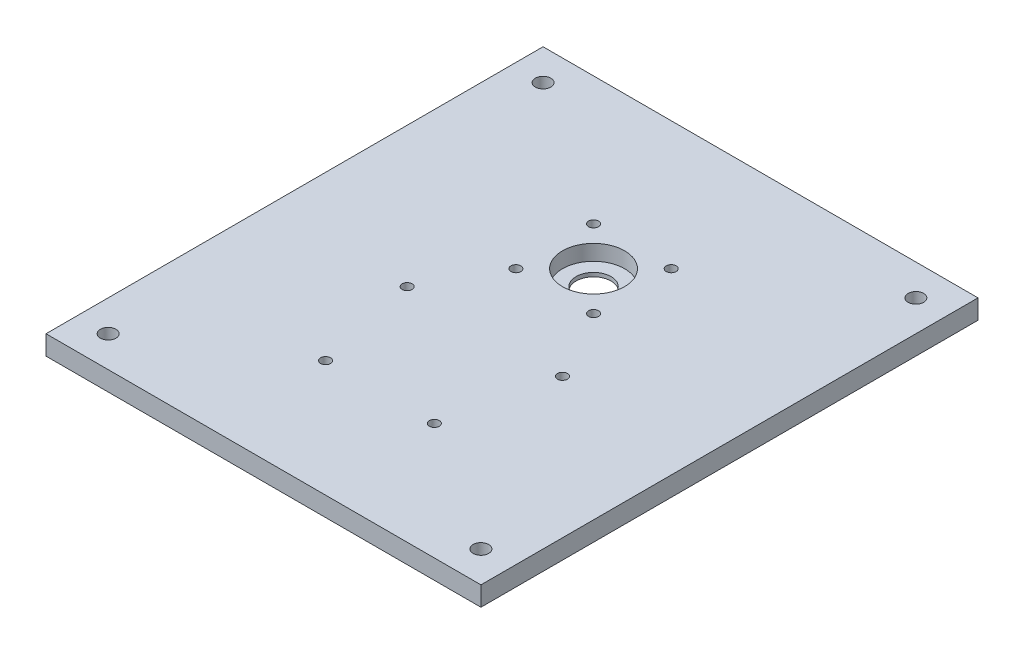
ISO-10303-21;
HEADER;
FILE_DESCRIPTION(('STEP AP214'),'2;1');
FILE_NAME('part.step','',(''),(''),'','','');
FILE_SCHEMA(('AUTOMOTIVE_DESIGN { 1 0 10303 214 1 1 1 1 }'));
ENDSEC;
DATA;
#1=APPLICATION_CONTEXT('core data for automotive mechanical design processes');
#2=APPLICATION_PROTOCOL_DEFINITION('international standard','automotive_design',2000,#1);
#3=PRODUCT_CONTEXT('',#1,'mechanical');
#4=PRODUCT('Part','Part','',(#3));
#5=PRODUCT_RELATED_PRODUCT_CATEGORY('part','',(#4));
#6=PRODUCT_DEFINITION_FORMATION('','',#4);
#7=PRODUCT_DEFINITION_CONTEXT('part definition',#1,'design');
#8=PRODUCT_DEFINITION('design','',#6,#7);
#9=PRODUCT_DEFINITION_SHAPE('','',#8);
#10=(LENGTH_UNIT() NAMED_UNIT(*) SI_UNIT(.MILLI.,.METRE.));
#11=(NAMED_UNIT(*) PLANE_ANGLE_UNIT() SI_UNIT($,.RADIAN.));
#12=(NAMED_UNIT(*) SI_UNIT($,.STERADIAN.) SOLID_ANGLE_UNIT());
#13=UNCERTAINTY_MEASURE_WITH_UNIT(LENGTH_MEASURE(1.E-05),#10,'distance_accuracy_value','');
#14=(GEOMETRIC_REPRESENTATION_CONTEXT(3) GLOBAL_UNCERTAINTY_ASSIGNED_CONTEXT((#13)) GLOBAL_UNIT_ASSIGNED_CONTEXT((#10,
#11,#12)) REPRESENTATION_CONTEXT('',''));
#15=CARTESIAN_POINT('',(0.,0.,0.));
#16=DIRECTION('',(0.,0.,1.));
#17=DIRECTION('',(1.,0.,0.));
#18=AXIS2_PLACEMENT_3D('',#15,#16,#17);
#19=CARTESIAN_POINT('',(-44.45,0.,107.95));
#20=DIRECTION('',(0.,1.,0.));
#21=DIRECTION('',(0.,0.,1.));
#22=AXIS2_PLACEMENT_3D('',#19,#20,#21);
#23=CYLINDRICAL_SURFACE('',#22,4.06400000000002);
#24=CARTESIAN_POINT('',(-44.45,15.875,107.95));
#25=DIRECTION('',(0.,1.,0.));
#26=DIRECTION('',(0.,0.,1.));
#27=AXIS2_PLACEMENT_3D('',#24,#25,#26);
#28=CIRCLE('',#27,4.06400000000002);
#29=CARTESIAN_POINT('',(-44.45,15.875,112.014));
#30=VERTEX_POINT('',#29);
#31=EDGE_CURVE('E200',#30,#30,#28,.T.);
#32=ORIENTED_EDGE('',*,*,#31,.T.);
#33=EDGE_LOOP('',(#32));
#34=FACE_BOUND('',#33,.T.);
#35=CARTESIAN_POINT('',(-44.45,8.89,107.95));
#36=DIRECTION('',(0.,-1.,0.));
#37=DIRECTION('',(0.,0.,-1.));
#38=AXIS2_PLACEMENT_3D('',#35,#36,#37);
#39=CIRCLE('',#38,4.06400000000002);
#40=CARTESIAN_POINT('',(-44.45,8.89,103.886));
#41=VERTEX_POINT('',#40);
#42=EDGE_CURVE('E37',#41,#41,#39,.F.);
#43=ORIENTED_EDGE('',*,*,#42,.F.);
#44=EDGE_LOOP('',(#43));
#45=FACE_BOUND('',#44,.T.);
#46=ADVANCED_FACE('F33',(#34,#45),#23,.F.);
#47=CARTESIAN_POINT('',(44.45,0.,107.95));
#48=DIRECTION('',(0.,1.,0.));
#49=DIRECTION('',(0.,0.,1.));
#50=AXIS2_PLACEMENT_3D('',#47,#48,#49);
#51=CYLINDRICAL_SURFACE('',#50,4.06400000000002);
#52=CARTESIAN_POINT('',(44.45,15.875,107.95));
#53=DIRECTION('',(0.,1.,0.));
#54=DIRECTION('',(0.,0.,1.));
#55=AXIS2_PLACEMENT_3D('',#52,#53,#54);
#56=CIRCLE('',#55,4.06400000000002);
#57=CARTESIAN_POINT('',(44.45,15.875,112.014));
#58=VERTEX_POINT('',#57);
#59=EDGE_CURVE('E203',#58,#58,#56,.T.);
#60=ORIENTED_EDGE('',*,*,#59,.T.);
#61=EDGE_LOOP('',(#60));
#62=FACE_BOUND('',#61,.T.);
#63=CARTESIAN_POINT('',(44.45,8.89,107.95));
#64=DIRECTION('',(0.,-1.,0.));
#65=DIRECTION('',(0.,0.,-1.));
#66=AXIS2_PLACEMENT_3D('',#63,#64,#65);
#67=CIRCLE('',#66,4.06400000000002);
#68=CARTESIAN_POINT('',(44.45,8.89,103.886));
#69=VERTEX_POINT('',#68);
#70=EDGE_CURVE('E144',#69,#69,#67,.F.);
#71=ORIENTED_EDGE('',*,*,#70,.F.);
#72=EDGE_LOOP('',(#71));
#73=FACE_BOUND('',#72,.T.);
#74=ADVANCED_FACE('F259',(#62,#73),#51,.F.);
#75=CARTESIAN_POINT('',(63.5,0.,22.225));
#76=DIRECTION('',(0.,1.,0.));
#77=DIRECTION('',(0.,0.,1.));
#78=AXIS2_PLACEMENT_3D('',#75,#76,#77);
#79=CYLINDRICAL_SURFACE('',#78,4.06400000000002);
#80=CARTESIAN_POINT('',(63.5,15.875,22.225));
#81=DIRECTION('',(0.,1.,0.));
#82=DIRECTION('',(0.,0.,1.));
#83=AXIS2_PLACEMENT_3D('',#80,#81,#82);
#84=CIRCLE('',#83,4.06400000000002);
#85=CARTESIAN_POINT('',(63.5,15.875,26.2890000000001));
#86=VERTEX_POINT('',#85);
#87=EDGE_CURVE('E206',#86,#86,#84,.T.);
#88=ORIENTED_EDGE('',*,*,#87,.T.);
#89=EDGE_LOOP('',(#88));
#90=FACE_BOUND('',#89,.T.);
#91=CARTESIAN_POINT('',(63.5,8.89,22.225));
#92=DIRECTION('',(0.,-1.,0.));
#93=DIRECTION('',(0.,0.,-1.));
#94=AXIS2_PLACEMENT_3D('',#91,#92,#93);
#95=CIRCLE('',#94,4.06400000000002);
#96=CARTESIAN_POINT('',(63.5,8.89,18.161));
#97=VERTEX_POINT('',#96);
#98=EDGE_CURVE('E140',#97,#97,#95,.F.);
#99=ORIENTED_EDGE('',*,*,#98,.F.);
#100=EDGE_LOOP('',(#99));
#101=FACE_BOUND('',#100,.T.);
#102=ADVANCED_FACE('F265',(#90,#101),#79,.F.);
#103=CARTESIAN_POINT('',(-63.5,0.,22.2250000000001));
#104=DIRECTION('',(0.,1.,0.));
#105=DIRECTION('',(0.,0.,1.));
#106=AXIS2_PLACEMENT_3D('',#103,#104,#105);
#107=CYLINDRICAL_SURFACE('',#106,4.06400000000001);
#108=CARTESIAN_POINT('',(-63.5,15.875,22.2250000000001));
#109=DIRECTION('',(0.,1.,0.));
#110=DIRECTION('',(0.,0.,1.));
#111=AXIS2_PLACEMENT_3D('',#108,#109,#110);
#112=CIRCLE('',#111,4.06400000000001);
#113=CARTESIAN_POINT('',(-63.5,15.875,26.2890000000001));
#114=VERTEX_POINT('',#113);
#115=EDGE_CURVE('E209',#114,#114,#112,.T.);
#116=ORIENTED_EDGE('',*,*,#115,.T.);
#117=EDGE_LOOP('',(#116));
#118=FACE_BOUND('',#117,.T.);
#119=CARTESIAN_POINT('',(-63.5,8.89,22.2250000000001));
#120=DIRECTION('',(0.,-1.,0.));
#121=DIRECTION('',(0.,0.,-1.));
#122=AXIS2_PLACEMENT_3D('',#119,#120,#121);
#123=CIRCLE('',#122,4.06400000000001);
#124=CARTESIAN_POINT('',(-63.5,8.89,18.161));
#125=VERTEX_POINT('',#124);
#126=EDGE_CURVE('E135',#125,#125,#123,.F.);
#127=ORIENTED_EDGE('',*,*,#126,.F.);
#128=EDGE_LOOP('',(#127));
#129=FACE_BOUND('',#128,.T.);
#130=ADVANCED_FACE('F274',(#118,#129),#107,.F.);
#131=CARTESIAN_POINT('',(-31.75,0.,-34.925));
#132=DIRECTION('',(0.,1.,0.));
#133=DIRECTION('',(0.,0.,1.));
#134=AXIS2_PLACEMENT_3D('',#131,#132,#133);
#135=CYLINDRICAL_SURFACE('',#134,4.06400000000001);
#136=CARTESIAN_POINT('',(-31.75,15.875,-34.925));
#137=DIRECTION('',(0.,1.,0.));
#138=DIRECTION('',(0.,0.,1.));
#139=AXIS2_PLACEMENT_3D('',#136,#137,#138);
#140=CIRCLE('',#139,4.06400000000001);
#141=CARTESIAN_POINT('',(-31.75,15.875,-30.861));
#142=VERTEX_POINT('',#141);
#143=EDGE_CURVE('E194',#142,#142,#140,.T.);
#144=ORIENTED_EDGE('',*,*,#143,.T.);
#145=EDGE_LOOP('',(#144));
#146=FACE_BOUND('',#145,.T.);
#147=CARTESIAN_POINT('',(-31.75,8.89,-34.925));
#148=DIRECTION('',(0.,-1.,0.));
#149=DIRECTION('',(0.,0.,-1.));
#150=AXIS2_PLACEMENT_3D('',#147,#148,#149);
#151=CIRCLE('',#150,4.06400000000001);
#152=CARTESIAN_POINT('',(-31.75,8.89,-38.989));
#153=VERTEX_POINT('',#152);
#154=EDGE_CURVE('E130',#153,#153,#151,.F.);
#155=ORIENTED_EDGE('',*,*,#154,.F.);
#156=EDGE_LOOP('',(#155));
#157=FACE_BOUND('',#156,.T.);
#158=ADVANCED_FACE('F277',(#146,#157),#135,.F.);
#159=CARTESIAN_POINT('',(31.75,0.,-34.925));
#160=DIRECTION('',(0.,1.,0.));
#161=DIRECTION('',(0.,0.,1.));
#162=AXIS2_PLACEMENT_3D('',#159,#160,#161);
#163=CYLINDRICAL_SURFACE('',#162,4.06400000000001);
#164=CARTESIAN_POINT('',(31.75,15.875,-34.925));
#165=DIRECTION('',(0.,1.,0.));
#166=DIRECTION('',(0.,0.,1.));
#167=AXIS2_PLACEMENT_3D('',#164,#165,#166);
#168=CIRCLE('',#167,4.06400000000001);
#169=CARTESIAN_POINT('',(31.75,15.875,-30.861));
#170=VERTEX_POINT('',#169);
#171=EDGE_CURVE('E113',#170,#170,#168,.T.);
#172=ORIENTED_EDGE('',*,*,#171,.T.);
#173=EDGE_LOOP('',(#172));
#174=FACE_BOUND('',#173,.T.);
#175=CARTESIAN_POINT('',(31.75,8.89,-34.925));
#176=DIRECTION('',(0.,-1.,0.));
#177=DIRECTION('',(0.,0.,-1.));
#178=AXIS2_PLACEMENT_3D('',#175,#176,#177);
#179=CIRCLE('',#178,4.06400000000001);
#180=CARTESIAN_POINT('',(31.75,8.89,-38.989));
#181=VERTEX_POINT('',#180);
#182=EDGE_CURVE('E125',#181,#181,#179,.F.);
#183=ORIENTED_EDGE('',*,*,#182,.F.);
#184=EDGE_LOOP('',(#183));
#185=FACE_BOUND('',#184,.T.);
#186=ADVANCED_FACE('F415',(#174,#185),#163,.F.);
#187=CARTESIAN_POINT('',(31.75,0.,-98.425));
#188=DIRECTION('',(0.,1.,0.));
#189=DIRECTION('',(0.,0.,1.));
#190=AXIS2_PLACEMENT_3D('',#187,#188,#189);
#191=CYLINDRICAL_SURFACE('',#190,4.06400000000002);
#192=CARTESIAN_POINT('',(31.75,15.875,-98.425));
#193=DIRECTION('',(0.,1.,0.));
#194=DIRECTION('',(0.,0.,1.));
#195=AXIS2_PLACEMENT_3D('',#192,#193,#194);
#196=CIRCLE('',#195,4.06400000000002);
#197=CARTESIAN_POINT('',(31.75,15.875,-94.361));
#198=VERTEX_POINT('',#197);
#199=EDGE_CURVE('E191',#198,#198,#196,.T.);
#200=ORIENTED_EDGE('',*,*,#199,.T.);
#201=EDGE_LOOP('',(#200));
#202=FACE_BOUND('',#201,.T.);
#203=CARTESIAN_POINT('',(31.75,8.89,-98.425));
#204=DIRECTION('',(0.,-1.,0.));
#205=DIRECTION('',(0.,0.,-1.));
#206=AXIS2_PLACEMENT_3D('',#203,#204,#205);
#207=CIRCLE('',#206,4.06400000000002);
#208=CARTESIAN_POINT('',(31.75,8.89,-102.489));
#209=VERTEX_POINT('',#208);
#210=EDGE_CURVE('E120',#209,#209,#207,.F.);
#211=ORIENTED_EDGE('',*,*,#210,.F.);
#212=EDGE_LOOP('',(#211));
#213=FACE_BOUND('',#212,.T.);
#214=ADVANCED_FACE('F424',(#202,#213),#191,.F.);
#215=CARTESIAN_POINT('',(-31.75,0.,-98.425));
#216=DIRECTION('',(0.,1.,0.));
#217=DIRECTION('',(0.,0.,1.));
#218=AXIS2_PLACEMENT_3D('',#215,#216,#217);
#219=CYLINDRICAL_SURFACE('',#218,4.06400000000002);
#220=CARTESIAN_POINT('',(-31.75,15.875,-98.425));
#221=DIRECTION('',(0.,1.,0.));
#222=DIRECTION('',(0.,0.,1.));
#223=AXIS2_PLACEMENT_3D('',#220,#221,#222);
#224=CIRCLE('',#223,4.06400000000002);
#225=CARTESIAN_POINT('',(-31.75,15.875,-94.361));
#226=VERTEX_POINT('',#225);
#227=EDGE_CURVE('E197',#226,#226,#224,.T.);
#228=ORIENTED_EDGE('',*,*,#227,.T.);
#229=EDGE_LOOP('',(#228));
#230=FACE_BOUND('',#229,.T.);
#231=CARTESIAN_POINT('',(-31.75,8.89,-98.425));
#232=DIRECTION('',(0.,-1.,0.));
#233=DIRECTION('',(0.,0.,-1.));
#234=AXIS2_PLACEMENT_3D('',#231,#232,#233);
#235=CIRCLE('',#234,4.06400000000002);
#236=CARTESIAN_POINT('',(-31.75,8.89,-102.489));
#237=VERTEX_POINT('',#236);
#238=EDGE_CURVE('E115',#237,#237,#235,.F.);
#239=ORIENTED_EDGE('',*,*,#238,.F.);
#240=EDGE_LOOP('',(#239));
#241=FACE_BOUND('',#240,.T.);
#242=ADVANCED_FACE('F252',(#230,#241),#219,.F.);
#243=CARTESIAN_POINT('',(0.,0.,-66.675));
#244=DIRECTION('',(0.,1.,0.));
#245=DIRECTION('',(0.,0.,1.));
#246=AXIS2_PLACEMENT_3D('',#243,#244,#245);
#247=CYLINDRICAL_SURFACE('',#246,14.2875);
#248=CARTESIAN_POINT('',(0.,0.,-66.675));
#249=DIRECTION('',(0.,1.,0.));
#250=DIRECTION('',(0.,0.,1.));
#251=AXIS2_PLACEMENT_3D('',#248,#249,#250);
#252=CIRCLE('',#251,14.2875);
#253=CARTESIAN_POINT('',(0.,0.,-52.3875));
#254=VERTEX_POINT('',#253);
#255=EDGE_CURVE('E212',#254,#254,#252,.T.);
#256=ORIENTED_EDGE('',*,*,#255,.F.);
#257=EDGE_LOOP('',(#256));
#258=FACE_BOUND('',#257,.T.);
#259=CARTESIAN_POINT('',(0.,3.175,-66.675));
#260=DIRECTION('',(0.,1.,0.));
#261=DIRECTION('',(0.,0.,1.));
#262=AXIS2_PLACEMENT_3D('',#259,#260,#261);
#263=CIRCLE('',#262,14.2875);
#264=CARTESIAN_POINT('',(0.,3.175,-52.3875));
#265=VERTEX_POINT('',#264);
#266=EDGE_CURVE('E110',#265,#265,#263,.F.);
#267=ORIENTED_EDGE('',*,*,#266,.F.);
#268=EDGE_LOOP('',(#267));
#269=FACE_BOUND('',#268,.T.);
#270=ADVANCED_FACE('F243',(#258,#269),#247,.F.);
#271=CARTESIAN_POINT('',(0.,15.875,0.));
#272=DIRECTION('',(0.,1.,0.));
#273=DIRECTION('',(0.,0.,1.));
#274=AXIS2_PLACEMENT_3D('',#271,#272,#273);
#275=PLANE('',#274);
#276=CARTESIAN_POINT('',(0.,15.875,-66.675));
#277=DIRECTION('',(0.,1.,0.));
#278=DIRECTION('',(0.,0.,1.));
#279=AXIS2_PLACEMENT_3D('',#276,#277,#278);
#280=CIRCLE('',#279,25.4);
#281=CARTESIAN_POINT('',(0.,15.875,-41.275));
#282=VERTEX_POINT('',#281);
#283=EDGE_CURVE('E118',#282,#282,#280,.T.);
#284=ORIENTED_EDGE('',*,*,#283,.F.);
#285=EDGE_LOOP('',(#284));
#286=FACE_BOUND('',#285,.T.);
#287=ORIENTED_EDGE('',*,*,#171,.F.);
#288=EDGE_LOOP('',(#287));
#289=FACE_BOUND('',#288,.T.);
#290=ORIENTED_EDGE('',*,*,#199,.F.);
#291=EDGE_LOOP('',(#290));
#292=FACE_BOUND('',#291,.T.);
#293=ORIENTED_EDGE('',*,*,#143,.F.);
#294=EDGE_LOOP('',(#293));
#295=FACE_BOUND('',#294,.T.);
#296=ORIENTED_EDGE('',*,*,#227,.F.);
#297=EDGE_LOOP('',(#296));
#298=FACE_BOUND('',#297,.T.);
#299=ORIENTED_EDGE('',*,*,#31,.F.);
#300=EDGE_LOOP('',(#299));
#301=FACE_BOUND('',#300,.T.);
#302=ORIENTED_EDGE('',*,*,#59,.F.);
#303=EDGE_LOOP('',(#302));
#304=FACE_BOUND('',#303,.T.);
#305=ORIENTED_EDGE('',*,*,#87,.F.);
#306=EDGE_LOOP('',(#305));
#307=FACE_BOUND('',#306,.T.);
#308=ORIENTED_EDGE('',*,*,#115,.F.);
#309=EDGE_LOOP('',(#308));
#310=FACE_BOUND('',#309,.T.);
#311=CARTESIAN_POINT('',(152.4,15.875,-177.8));
#312=DIRECTION('',(0.,-1.,0.));
#313=DIRECTION('',(0.,0.,1.));
#314=AXIS2_PLACEMENT_3D('',#311,#312,#313);
#315=CIRCLE('',#314,6.34999999999999);
#316=CARTESIAN_POINT('',(152.4,15.875,-171.45));
#317=VERTEX_POINT('',#316);
#318=EDGE_CURVE('E225',#317,#317,#315,.T.);
#319=ORIENTED_EDGE('',*,*,#318,.T.);
#320=EDGE_LOOP('',(#319));
#321=FACE_BOUND('',#320,.T.);
#322=CARTESIAN_POINT('',(-152.4,15.875,-177.8));
#323=DIRECTION('',(0.,1.,0.));
#324=DIRECTION('',(0.,0.,1.));
#325=AXIS2_PLACEMENT_3D('',#322,#323,#324);
#326=CIRCLE('',#325,6.34999999999999);
#327=CARTESIAN_POINT('',(-152.4,15.875,-171.45));
#328=VERTEX_POINT('',#327);
#329=EDGE_CURVE('E231',#328,#328,#326,.T.);
#330=ORIENTED_EDGE('',*,*,#329,.F.);
#331=EDGE_LOOP('',(#330));
#332=FACE_BOUND('',#331,.T.);
#333=DIRECTION('',(0.,0.,-1.));
#334=VECTOR('',#333,1.);
#335=CARTESIAN_POINT('',(177.8,15.875,-203.2));
#336=LINE('',#335,#334);
#337=CARTESIAN_POINT('',(177.8,15.875,203.2));
#338=VERTEX_POINT('',#337);
#339=CARTESIAN_POINT('',(177.8,15.875,-203.2));
#340=VERTEX_POINT('',#339);
#341=EDGE_CURVE('E88',#338,#340,#336,.T.);
#342=ORIENTED_EDGE('',*,*,#341,.T.);
#343=DIRECTION('',(-1.,0.,0.));
#344=VECTOR('',#343,1.);
#345=CARTESIAN_POINT('',(-177.8,15.875,-203.2));
#346=LINE('',#345,#344);
#347=CARTESIAN_POINT('',(-177.8,15.875,-203.2));
#348=VERTEX_POINT('',#347);
#349=EDGE_CURVE('E82',#340,#348,#346,.T.);
#350=ORIENTED_EDGE('',*,*,#349,.T.);
#351=DIRECTION('',(0.,0.,1.));
#352=VECTOR('',#351,1.);
#353=CARTESIAN_POINT('',(-177.8,15.875,-203.2));
#354=LINE('',#353,#352);
#355=CARTESIAN_POINT('',(-177.8,15.875,203.2));
#356=VERTEX_POINT('',#355);
#357=EDGE_CURVE('E86',#348,#356,#354,.T.);
#358=ORIENTED_EDGE('',*,*,#357,.T.);
#359=DIRECTION('',(1.,0.,0.));
#360=VECTOR('',#359,1.);
#361=CARTESIAN_POINT('',(-177.8,15.875,203.2));
#362=LINE('',#361,#360);
#363=EDGE_CURVE('E52',#356,#338,#362,.T.);
#364=ORIENTED_EDGE('',*,*,#363,.T.);
#365=EDGE_LOOP('',(#342,#350,#358,#364));
#366=FACE_BOUND('',#365,.T.);
#367=CARTESIAN_POINT('',(152.4,15.875,177.8));
#368=DIRECTION('',(0.,1.,0.));
#369=DIRECTION('',(0.,0.,-1.));
#370=AXIS2_PLACEMENT_3D('',#367,#368,#369);
#371=CIRCLE('',#370,6.34999999999999);
#372=CARTESIAN_POINT('',(152.4,15.875,171.45));
#373=VERTEX_POINT('',#372);
#374=EDGE_CURVE('E219',#373,#373,#371,.T.);
#375=ORIENTED_EDGE('',*,*,#374,.F.);
#376=EDGE_LOOP('',(#375));
#377=FACE_BOUND('',#376,.T.);
#378=CARTESIAN_POINT('',(-152.4,15.875,177.8));
#379=DIRECTION('',(0.,-1.,0.));
#380=DIRECTION('',(0.,0.,-1.));
#381=AXIS2_PLACEMENT_3D('',#378,#379,#380);
#382=CIRCLE('',#381,6.34999999999999);
#383=CARTESIAN_POINT('',(-152.4,15.875,171.45));
#384=VERTEX_POINT('',#383);
#385=EDGE_CURVE('E215',#384,#384,#382,.T.);
#386=ORIENTED_EDGE('',*,*,#385,.T.);
#387=EDGE_LOOP('',(#386));
#388=FACE_BOUND('',#387,.T.);
#389=ADVANCED_FACE('F83',(#286,#289,#292,#295,#298,#301,#304,#307,#310,#321,#332,#366,#377,
#388),#275,.T.);
#390=CARTESIAN_POINT('',(0.,0.,0.));
#391=DIRECTION('',(0.,1.,0.));
#392=DIRECTION('',(0.,0.,1.));
#393=AXIS2_PLACEMENT_3D('',#390,#391,#392);
#394=PLANE('',#393);
#395=CARTESIAN_POINT('',(-44.45,0.,107.95));
#396=DIRECTION('',(0.,-1.,0.));
#397=DIRECTION('',(0.,0.,-1.));
#398=AXIS2_PLACEMENT_3D('',#395,#396,#397);
#399=CIRCLE('',#398,6.35);
#400=CARTESIAN_POINT('',(-44.45,0.,101.6));
#401=VERTEX_POINT('',#400);
#402=EDGE_CURVE('E160',#401,#401,#399,.T.);
#403=ORIENTED_EDGE('',*,*,#402,.F.);
#404=EDGE_LOOP('',(#403));
#405=FACE_BOUND('',#404,.T.);
#406=CARTESIAN_POINT('',(44.45,0.,107.95));
#407=DIRECTION('',(0.,-1.,0.));
#408=DIRECTION('',(0.,0.,-1.));
#409=AXIS2_PLACEMENT_3D('',#406,#407,#408);
#410=CIRCLE('',#409,6.35);
#411=CARTESIAN_POINT('',(44.45,0.,101.6));
#412=VERTEX_POINT('',#411);
#413=EDGE_CURVE('E153',#412,#412,#410,.T.);
#414=ORIENTED_EDGE('',*,*,#413,.F.);
#415=EDGE_LOOP('',(#414));
#416=FACE_BOUND('',#415,.T.);
#417=CARTESIAN_POINT('',(63.5,0.,22.225));
#418=DIRECTION('',(0.,-1.,0.));
#419=DIRECTION('',(0.,0.,-1.));
#420=AXIS2_PLACEMENT_3D('',#417,#418,#419);
#421=CIRCLE('',#420,6.35);
#422=CARTESIAN_POINT('',(63.5,0.,15.875));
#423=VERTEX_POINT('',#422);
#424=EDGE_CURVE('E146',#423,#423,#421,.T.);
#425=ORIENTED_EDGE('',*,*,#424,.F.);
#426=EDGE_LOOP('',(#425));
#427=FACE_BOUND('',#426,.T.);
#428=CARTESIAN_POINT('',(-63.5,0.,22.2250000000001));
#429=DIRECTION('',(0.,-1.,0.));
#430=DIRECTION('',(0.,0.,-1.));
#431=AXIS2_PLACEMENT_3D('',#428,#429,#430);
#432=CIRCLE('',#431,6.35);
#433=CARTESIAN_POINT('',(-63.5,0.,15.875));
#434=VERTEX_POINT('',#433);
#435=EDGE_CURVE('E142',#434,#434,#432,.T.);
#436=ORIENTED_EDGE('',*,*,#435,.F.);
#437=EDGE_LOOP('',(#436));
#438=FACE_BOUND('',#437,.T.);
#439=CARTESIAN_POINT('',(-31.75,0.,-34.925));
#440=DIRECTION('',(0.,-1.,0.));
#441=DIRECTION('',(0.,0.,-1.));
#442=AXIS2_PLACEMENT_3D('',#439,#440,#441);
#443=CIRCLE('',#442,6.35);
#444=CARTESIAN_POINT('',(-31.75,0.,-41.275));
#445=VERTEX_POINT('',#444);
#446=EDGE_CURVE('E138',#445,#445,#443,.T.);
#447=ORIENTED_EDGE('',*,*,#446,.F.);
#448=EDGE_LOOP('',(#447));
#449=FACE_BOUND('',#448,.T.);
#450=CARTESIAN_POINT('',(31.75,0.,-34.925));
#451=DIRECTION('',(0.,-1.,0.));
#452=DIRECTION('',(0.,0.,-1.));
#453=AXIS2_PLACEMENT_3D('',#450,#451,#452);
#454=CIRCLE('',#453,6.35);
#455=CARTESIAN_POINT('',(31.75,0.,-41.275));
#456=VERTEX_POINT('',#455);
#457=EDGE_CURVE('E133',#456,#456,#454,.T.);
#458=ORIENTED_EDGE('',*,*,#457,.F.);
#459=EDGE_LOOP('',(#458));
#460=FACE_BOUND('',#459,.T.);
#461=CARTESIAN_POINT('',(31.75,0.,-98.425));
#462=DIRECTION('',(0.,-1.,0.));
#463=DIRECTION('',(0.,0.,-1.));
#464=AXIS2_PLACEMENT_3D('',#461,#462,#463);
#465=CIRCLE('',#464,6.35);
#466=CARTESIAN_POINT('',(31.75,0.,-104.775));
#467=VERTEX_POINT('',#466);
#468=EDGE_CURVE('E128',#467,#467,#465,.T.);
#469=ORIENTED_EDGE('',*,*,#468,.F.);
#470=EDGE_LOOP('',(#469));
#471=FACE_BOUND('',#470,.T.);
#472=CARTESIAN_POINT('',(-31.75,0.,-98.425));
#473=DIRECTION('',(0.,-1.,0.));
#474=DIRECTION('',(0.,0.,-1.));
#475=AXIS2_PLACEMENT_3D('',#472,#473,#474);
#476=CIRCLE('',#475,6.35);
#477=CARTESIAN_POINT('',(-31.75,0.,-104.775));
#478=VERTEX_POINT('',#477);
#479=EDGE_CURVE('E123',#478,#478,#476,.T.);
#480=ORIENTED_EDGE('',*,*,#479,.F.);
#481=EDGE_LOOP('',(#480));
#482=FACE_BOUND('',#481,.T.);
#483=ORIENTED_EDGE('',*,*,#255,.T.);
#484=EDGE_LOOP('',(#483));
#485=FACE_BOUND('',#484,.T.);
#486=CARTESIAN_POINT('',(152.4,0.,-177.8));
#487=DIRECTION('',(0.,-1.,0.));
#488=DIRECTION('',(0.,0.,1.));
#489=AXIS2_PLACEMENT_3D('',#486,#487,#488);
#490=CIRCLE('',#489,6.34999999999999);
#491=CARTESIAN_POINT('',(152.4,0.,-171.45));
#492=VERTEX_POINT('',#491);
#493=EDGE_CURVE('E228',#492,#492,#490,.T.);
#494=ORIENTED_EDGE('',*,*,#493,.F.);
#495=EDGE_LOOP('',(#494));
#496=FACE_BOUND('',#495,.T.);
#497=CARTESIAN_POINT('',(-152.4,0.,-177.8));
#498=DIRECTION('',(0.,1.,0.));
#499=DIRECTION('',(0.,0.,1.));
#500=AXIS2_PLACEMENT_3D('',#497,#498,#499);
#501=CIRCLE('',#500,6.34999999999999);
#502=CARTESIAN_POINT('',(-152.4,0.,-171.45));
#503=VERTEX_POINT('',#502);
#504=EDGE_CURVE('E104',#503,#503,#501,.T.);
#505=ORIENTED_EDGE('',*,*,#504,.T.);
#506=EDGE_LOOP('',(#505));
#507=FACE_BOUND('',#506,.T.);
#508=DIRECTION('',(0.,0.,-1.));
#509=VECTOR('',#508,1.);
#510=CARTESIAN_POINT('',(177.8,0.,-203.2));
#511=LINE('',#510,#509);
#512=CARTESIAN_POINT('',(177.8,0.,203.2));
#513=VERTEX_POINT('',#512);
#514=CARTESIAN_POINT('',(177.8,0.,-203.2));
#515=VERTEX_POINT('',#514);
#516=EDGE_CURVE('E101',#513,#515,#511,.T.);
#517=ORIENTED_EDGE('',*,*,#516,.F.);
#518=DIRECTION('',(1.,0.,0.));
#519=VECTOR('',#518,1.);
#520=CARTESIAN_POINT('',(-177.8,0.,203.2));
#521=LINE('',#520,#519);
#522=CARTESIAN_POINT('',(-177.8,0.,203.2));
#523=VERTEX_POINT('',#522);
#524=EDGE_CURVE('E75',#523,#513,#521,.T.);
#525=ORIENTED_EDGE('',*,*,#524,.F.);
#526=DIRECTION('',(0.,0.,1.));
#527=VECTOR('',#526,1.);
#528=CARTESIAN_POINT('',(-177.8,0.,-203.2));
#529=LINE('',#528,#527);
#530=CARTESIAN_POINT('',(-177.8,0.,-203.2));
#531=VERTEX_POINT('',#530);
#532=EDGE_CURVE('E69',#531,#523,#529,.T.);
#533=ORIENTED_EDGE('',*,*,#532,.F.);
#534=DIRECTION('',(-1.,0.,0.));
#535=VECTOR('',#534,1.);
#536=CARTESIAN_POINT('',(-177.8,0.,-203.2));
#537=LINE('',#536,#535);
#538=EDGE_CURVE('E92',#515,#531,#537,.T.);
#539=ORIENTED_EDGE('',*,*,#538,.F.);
#540=EDGE_LOOP('',(#517,#525,#533,#539));
#541=FACE_BOUND('',#540,.T.);
#542=CARTESIAN_POINT('',(152.4,0.,177.8));
#543=DIRECTION('',(0.,1.,0.));
#544=DIRECTION('',(0.,0.,-1.));
#545=AXIS2_PLACEMENT_3D('',#542,#543,#544);
#546=CIRCLE('',#545,6.34999999999999);
#547=CARTESIAN_POINT('',(152.4,0.,171.45));
#548=VERTEX_POINT('',#547);
#549=EDGE_CURVE('E222',#548,#548,#546,.T.);
#550=ORIENTED_EDGE('',*,*,#549,.T.);
#551=EDGE_LOOP('',(#550));
#552=FACE_BOUND('',#551,.T.);
#553=CARTESIAN_POINT('',(-152.4,0.,177.8));
#554=DIRECTION('',(0.,-1.,0.));
#555=DIRECTION('',(0.,0.,-1.));
#556=AXIS2_PLACEMENT_3D('',#553,#554,#555);
#557=CIRCLE('',#556,6.34999999999999);
#558=CARTESIAN_POINT('',(-152.4,0.,171.45));
#559=VERTEX_POINT('',#558);
#560=EDGE_CURVE('E216',#559,#559,#557,.T.);
#561=ORIENTED_EDGE('',*,*,#560,.F.);
#562=EDGE_LOOP('',(#561));
#563=FACE_BOUND('',#562,.T.);
#564=ADVANCED_FACE('F242',(#405,#416,#427,#438,#449,#460,#471,#482,#485,#496,#507,#541,#552,
#563),#394,.F.);
#565=CARTESIAN_POINT('',(177.8,15.875,-203.2));
#566=DIRECTION('',(-1.,0.,0.));
#567=DIRECTION('',(0.,0.,1.));
#568=AXIS2_PLACEMENT_3D('',#565,#566,#567);
#569=PLANE('',#568);
#570=ORIENTED_EDGE('',*,*,#516,.T.);
#571=DIRECTION('',(0.,-1.,0.));
#572=VECTOR('',#571,1.);
#573=CARTESIAN_POINT('',(177.8,15.875,-203.2));
#574=LINE('',#573,#572);
#575=EDGE_CURVE('E11',#340,#515,#574,.T.);
#576=ORIENTED_EDGE('',*,*,#575,.F.);
#577=ORIENTED_EDGE('',*,*,#341,.F.);
#578=DIRECTION('',(0.,-1.,0.));
#579=VECTOR('',#578,1.);
#580=CARTESIAN_POINT('',(177.8,15.875,203.2));
#581=LINE('',#580,#579);
#582=EDGE_CURVE('E97',#338,#513,#581,.T.);
#583=ORIENTED_EDGE('',*,*,#582,.T.);
#584=EDGE_LOOP('',(#570,#576,#577,#583));
#585=FACE_BOUND('',#584,.T.);
#586=ADVANCED_FACE('F35',(#585),#569,.F.);
#587=CARTESIAN_POINT('',(-177.8,15.875,-203.2));
#588=DIRECTION('',(0.,0.,1.));
#589=DIRECTION('',(1.,0.,0.));
#590=AXIS2_PLACEMENT_3D('',#587,#588,#589);
#591=PLANE('',#590);
#592=ORIENTED_EDGE('',*,*,#538,.T.);
#593=DIRECTION('',(0.,-1.,0.));
#594=VECTOR('',#593,1.);
#595=CARTESIAN_POINT('',(-177.8,15.875,-203.2));
#596=LINE('',#595,#594);
#597=EDGE_CURVE('E43',#348,#531,#596,.T.);
#598=ORIENTED_EDGE('',*,*,#597,.F.);
#599=ORIENTED_EDGE('',*,*,#349,.F.);
#600=ORIENTED_EDGE('',*,*,#575,.T.);
#601=EDGE_LOOP('',(#592,#598,#599,#600));
#602=FACE_BOUND('',#601,.T.);
#603=ADVANCED_FACE('F91',(#602),#591,.F.);
#604=CARTESIAN_POINT('',(-177.8,15.875,-203.2));
#605=DIRECTION('',(1.,0.,0.));
#606=DIRECTION('',(0.,0.,-1.));
#607=AXIS2_PLACEMENT_3D('',#604,#605,#606);
#608=PLANE('',#607);
#609=ORIENTED_EDGE('',*,*,#532,.T.);
#610=DIRECTION('',(0.,-1.,0.));
#611=VECTOR('',#610,1.);
#612=CARTESIAN_POINT('',(-177.8,15.875,203.2));
#613=LINE('',#612,#611);
#614=EDGE_CURVE('E93',#356,#523,#613,.T.);
#615=ORIENTED_EDGE('',*,*,#614,.F.);
#616=ORIENTED_EDGE('',*,*,#357,.F.);
#617=ORIENTED_EDGE('',*,*,#597,.T.);
#618=EDGE_LOOP('',(#609,#615,#616,#617));
#619=FACE_BOUND('',#618,.T.);
#620=ADVANCED_FACE('F95',(#619),#608,.F.);
#621=CARTESIAN_POINT('',(-177.8,15.875,203.2));
#622=DIRECTION('',(0.,0.,-1.));
#623=DIRECTION('',(-1.,0.,0.));
#624=AXIS2_PLACEMENT_3D('',#621,#622,#623);
#625=PLANE('',#624);
#626=ORIENTED_EDGE('',*,*,#524,.T.);
#627=ORIENTED_EDGE('',*,*,#582,.F.);
#628=ORIENTED_EDGE('',*,*,#363,.F.);
#629=ORIENTED_EDGE('',*,*,#614,.T.);
#630=EDGE_LOOP('',(#626,#627,#628,#629));
#631=FACE_BOUND('',#630,.T.);
#632=ADVANCED_FACE('F293',(#631),#625,.F.);
#633=CARTESIAN_POINT('',(-152.4,0.,-177.8));
#634=DIRECTION('',(0.,1.,0.));
#635=DIRECTION('',(0.,0.,1.));
#636=AXIS2_PLACEMENT_3D('',#633,#634,#635);
#637=CYLINDRICAL_SURFACE('',#636,6.34999999999999);
#638=ORIENTED_EDGE('',*,*,#504,.F.);
#639=EDGE_LOOP('',(#638));
#640=FACE_BOUND('',#639,.T.);
#641=ORIENTED_EDGE('',*,*,#329,.T.);
#642=EDGE_LOOP('',(#641));
#643=FACE_BOUND('',#642,.T.);
#644=ADVANCED_FACE('F239',(#640,#643),#637,.F.);
#645=CARTESIAN_POINT('',(152.4,0.,-177.8));
#646=DIRECTION('',(0.,1.,0.));
#647=DIRECTION('',(0.,0.,1.));
#648=AXIS2_PLACEMENT_3D('',#645,#646,#647);
#649=CYLINDRICAL_SURFACE('',#648,6.34999999999999);
#650=ORIENTED_EDGE('',*,*,#493,.T.);
#651=EDGE_LOOP('',(#650));
#652=FACE_BOUND('',#651,.T.);
#653=ORIENTED_EDGE('',*,*,#318,.F.);
#654=EDGE_LOOP('',(#653));
#655=FACE_BOUND('',#654,.T.);
#656=ADVANCED_FACE('F288',(#652,#655),#649,.F.);
#657=CARTESIAN_POINT('',(152.4,0.,177.8));
#658=DIRECTION('',(0.,1.,0.));
#659=DIRECTION('',(0.,0.,1.));
#660=AXIS2_PLACEMENT_3D('',#657,#658,#659);
#661=CYLINDRICAL_SURFACE('',#660,6.34999999999999);
#662=ORIENTED_EDGE('',*,*,#549,.F.);
#663=EDGE_LOOP('',(#662));
#664=FACE_BOUND('',#663,.T.);
#665=ORIENTED_EDGE('',*,*,#374,.T.);
#666=EDGE_LOOP('',(#665));
#667=FACE_BOUND('',#666,.T.);
#668=ADVANCED_FACE('F284',(#664,#667),#661,.F.);
#669=CARTESIAN_POINT('',(-152.4,0.,177.8));
#670=DIRECTION('',(0.,1.,0.));
#671=DIRECTION('',(0.,0.,1.));
#672=AXIS2_PLACEMENT_3D('',#669,#670,#671);
#673=CYLINDRICAL_SURFACE('',#672,6.34999999999999);
#674=ORIENTED_EDGE('',*,*,#560,.T.);
#675=EDGE_LOOP('',(#674));
#676=FACE_BOUND('',#675,.T.);
#677=ORIENTED_EDGE('',*,*,#385,.F.);
#678=EDGE_LOOP('',(#677));
#679=FACE_BOUND('',#678,.T.);
#680=ADVANCED_FACE('F280',(#676,#679),#673,.F.);
#681=CARTESIAN_POINT('',(0.,3.175,-66.675));
#682=DIRECTION('',(0.,1.,0.));
#683=DIRECTION('',(0.,0.,1.));
#684=AXIS2_PLACEMENT_3D('',#681,#682,#683);
#685=PLANE('',#684);
#686=CARTESIAN_POINT('',(0.,3.175,-66.675));
#687=DIRECTION('',(0.,1.,0.));
#688=DIRECTION('',(0.,0.,1.));
#689=AXIS2_PLACEMENT_3D('',#686,#687,#688);
#690=CIRCLE('',#689,25.4);
#691=CARTESIAN_POINT('',(0.,3.175,-41.275));
#692=VERTEX_POINT('',#691);
#693=EDGE_CURVE('E114',#692,#692,#690,.T.);
#694=ORIENTED_EDGE('',*,*,#693,.T.);
#695=EDGE_LOOP('',(#694));
#696=FACE_BOUND('',#695,.T.);
#697=ORIENTED_EDGE('',*,*,#266,.T.);
#698=EDGE_LOOP('',(#697));
#699=FACE_BOUND('',#698,.T.);
#700=ADVANCED_FACE('F283',(#696,#699),#685,.T.);
#701=CARTESIAN_POINT('',(0.,3.175,-66.675));
#702=DIRECTION('',(0.,1.,0.));
#703=DIRECTION('',(0.,0.,1.));
#704=AXIS2_PLACEMENT_3D('',#701,#702,#703);
#705=CYLINDRICAL_SURFACE('',#704,25.4);
#706=ORIENTED_EDGE('',*,*,#693,.F.);
#707=EDGE_LOOP('',(#706));
#708=FACE_BOUND('',#707,.T.);
#709=ORIENTED_EDGE('',*,*,#283,.T.);
#710=EDGE_LOOP('',(#709));
#711=FACE_BOUND('',#710,.T.);
#712=ADVANCED_FACE('F370',(#708,#711),#705,.F.);
#713=CARTESIAN_POINT('',(-31.75,8.89,-98.425));
#714=DIRECTION('',(0.,-1.,0.));
#715=DIRECTION('',(0.,0.,-1.));
#716=AXIS2_PLACEMENT_3D('',#713,#714,#715);
#717=PLANE('',#716);
#718=CARTESIAN_POINT('',(-31.75,8.89,-98.425));
#719=DIRECTION('',(0.,-1.,0.));
#720=DIRECTION('',(0.,0.,-1.));
#721=AXIS2_PLACEMENT_3D('',#718,#719,#720);
#722=CIRCLE('',#721,6.35);
#723=CARTESIAN_POINT('',(-31.75,8.89,-104.775));
#724=VERTEX_POINT('',#723);
#725=EDGE_CURVE('E119',#724,#724,#722,.T.);
#726=ORIENTED_EDGE('',*,*,#725,.T.);
#727=EDGE_LOOP('',(#726));
#728=FACE_BOUND('',#727,.T.);
#729=ORIENTED_EDGE('',*,*,#238,.T.);
#730=EDGE_LOOP('',(#729));
#731=FACE_BOUND('',#730,.T.);
#732=ADVANCED_FACE('F379',(#728,#731),#717,.T.);
#733=CARTESIAN_POINT('',(-31.75,8.89,-98.425));
#734=DIRECTION('',(0.,-1.,0.));
#735=DIRECTION('',(0.,0.,-1.));
#736=AXIS2_PLACEMENT_3D('',#733,#734,#735);
#737=CYLINDRICAL_SURFACE('',#736,6.35);
#738=ORIENTED_EDGE('',*,*,#725,.F.);
#739=EDGE_LOOP('',(#738));
#740=FACE_BOUND('',#739,.T.);
#741=ORIENTED_EDGE('',*,*,#479,.T.);
#742=EDGE_LOOP('',(#741));
#743=FACE_BOUND('',#742,.T.);
#744=ADVANCED_FACE('F452',(#740,#743),#737,.F.);
#745=CARTESIAN_POINT('',(31.75,8.89,-98.425));
#746=DIRECTION('',(0.,-1.,0.));
#747=DIRECTION('',(0.,0.,-1.));
#748=AXIS2_PLACEMENT_3D('',#745,#746,#747);
#749=PLANE('',#748);
#750=CARTESIAN_POINT('',(31.75,8.89,-98.425));
#751=DIRECTION('',(0.,-1.,0.));
#752=DIRECTION('',(0.,0.,-1.));
#753=AXIS2_PLACEMENT_3D('',#750,#751,#752);
#754=CIRCLE('',#753,6.35);
#755=CARTESIAN_POINT('',(31.75,8.89,-104.775));
#756=VERTEX_POINT('',#755);
#757=EDGE_CURVE('E124',#756,#756,#754,.T.);
#758=ORIENTED_EDGE('',*,*,#757,.T.);
#759=EDGE_LOOP('',(#758));
#760=FACE_BOUND('',#759,.T.);
#761=ORIENTED_EDGE('',*,*,#210,.T.);
#762=EDGE_LOOP('',(#761));
#763=FACE_BOUND('',#762,.T.);
#764=ADVANCED_FACE('F462',(#760,#763),#749,.T.);
#765=CARTESIAN_POINT('',(31.75,8.89,-98.425));
#766=DIRECTION('',(0.,-1.,0.));
#767=DIRECTION('',(0.,0.,-1.));
#768=AXIS2_PLACEMENT_3D('',#765,#766,#767);
#769=CYLINDRICAL_SURFACE('',#768,6.35);
#770=ORIENTED_EDGE('',*,*,#757,.F.);
#771=EDGE_LOOP('',(#770));
#772=FACE_BOUND('',#771,.T.);
#773=ORIENTED_EDGE('',*,*,#468,.T.);
#774=EDGE_LOOP('',(#773));
#775=FACE_BOUND('',#774,.T.);
#776=ADVANCED_FACE('F472',(#772,#775),#769,.F.);
#777=CARTESIAN_POINT('',(31.75,8.89,-34.925));
#778=DIRECTION('',(0.,-1.,0.));
#779=DIRECTION('',(0.,0.,-1.));
#780=AXIS2_PLACEMENT_3D('',#777,#778,#779);
#781=PLANE('',#780);
#782=CARTESIAN_POINT('',(31.75,8.89,-34.925));
#783=DIRECTION('',(0.,-1.,0.));
#784=DIRECTION('',(0.,0.,-1.));
#785=AXIS2_PLACEMENT_3D('',#782,#783,#784);
#786=CIRCLE('',#785,6.35);
#787=CARTESIAN_POINT('',(31.75,8.89,-41.275));
#788=VERTEX_POINT('',#787);
#789=EDGE_CURVE('E129',#788,#788,#786,.T.);
#790=ORIENTED_EDGE('',*,*,#789,.T.);
#791=EDGE_LOOP('',(#790));
#792=FACE_BOUND('',#791,.T.);
#793=ORIENTED_EDGE('',*,*,#182,.T.);
#794=EDGE_LOOP('',(#793));
#795=FACE_BOUND('',#794,.T.);
#796=ADVANCED_FACE('F482',(#792,#795),#781,.T.);
#797=CARTESIAN_POINT('',(31.75,8.89,-34.925));
#798=DIRECTION('',(0.,-1.,0.));
#799=DIRECTION('',(0.,0.,-1.));
#800=AXIS2_PLACEMENT_3D('',#797,#798,#799);
#801=CYLINDRICAL_SURFACE('',#800,6.35);
#802=ORIENTED_EDGE('',*,*,#789,.F.);
#803=EDGE_LOOP('',(#802));
#804=FACE_BOUND('',#803,.T.);
#805=ORIENTED_EDGE('',*,*,#457,.T.);
#806=EDGE_LOOP('',(#805));
#807=FACE_BOUND('',#806,.T.);
#808=ADVANCED_FACE('F492',(#804,#807),#801,.F.);
#809=CARTESIAN_POINT('',(-31.75,8.89,-34.925));
#810=DIRECTION('',(0.,-1.,0.));
#811=DIRECTION('',(0.,0.,-1.));
#812=AXIS2_PLACEMENT_3D('',#809,#810,#811);
#813=PLANE('',#812);
#814=CARTESIAN_POINT('',(-31.75,8.89,-34.925));
#815=DIRECTION('',(0.,-1.,0.));
#816=DIRECTION('',(0.,0.,-1.));
#817=AXIS2_PLACEMENT_3D('',#814,#815,#816);
#818=CIRCLE('',#817,6.35);
#819=CARTESIAN_POINT('',(-31.75,8.89,-41.275));
#820=VERTEX_POINT('',#819);
#821=EDGE_CURVE('E134',#820,#820,#818,.T.);
#822=ORIENTED_EDGE('',*,*,#821,.T.);
#823=EDGE_LOOP('',(#822));
#824=FACE_BOUND('',#823,.T.);
#825=ORIENTED_EDGE('',*,*,#154,.T.);
#826=EDGE_LOOP('',(#825));
#827=FACE_BOUND('',#826,.T.);
#828=ADVANCED_FACE('F502',(#824,#827),#813,.T.);
#829=CARTESIAN_POINT('',(-31.75,8.89,-34.925));
#830=DIRECTION('',(0.,-1.,0.));
#831=DIRECTION('',(0.,0.,-1.));
#832=AXIS2_PLACEMENT_3D('',#829,#830,#831);
#833=CYLINDRICAL_SURFACE('',#832,6.35);
#834=ORIENTED_EDGE('',*,*,#821,.F.);
#835=EDGE_LOOP('',(#834));
#836=FACE_BOUND('',#835,.T.);
#837=ORIENTED_EDGE('',*,*,#446,.T.);
#838=EDGE_LOOP('',(#837));
#839=FACE_BOUND('',#838,.T.);
#840=ADVANCED_FACE('F512',(#836,#839),#833,.F.);
#841=CARTESIAN_POINT('',(-63.5,8.89,22.2250000000001));
#842=DIRECTION('',(0.,-1.,0.));
#843=DIRECTION('',(0.,0.,-1.));
#844=AXIS2_PLACEMENT_3D('',#841,#842,#843);
#845=PLANE('',#844);
#846=CARTESIAN_POINT('',(-63.5,8.89,22.2250000000001));
#847=DIRECTION('',(0.,-1.,0.));
#848=DIRECTION('',(0.,0.,-1.));
#849=AXIS2_PLACEMENT_3D('',#846,#847,#848);
#850=CIRCLE('',#849,6.35);
#851=CARTESIAN_POINT('',(-63.5,8.89,15.875));
#852=VERTEX_POINT('',#851);
#853=EDGE_CURVE('E139',#852,#852,#850,.T.);
#854=ORIENTED_EDGE('',*,*,#853,.T.);
#855=EDGE_LOOP('',(#854));
#856=FACE_BOUND('',#855,.T.);
#857=ORIENTED_EDGE('',*,*,#126,.T.);
#858=EDGE_LOOP('',(#857));
#859=FACE_BOUND('',#858,.T.);
#860=ADVANCED_FACE('F522',(#856,#859),#845,.T.);
#861=CARTESIAN_POINT('',(-63.5,8.89,22.2250000000001));
#862=DIRECTION('',(0.,-1.,0.));
#863=DIRECTION('',(0.,0.,-1.));
#864=AXIS2_PLACEMENT_3D('',#861,#862,#863);
#865=CYLINDRICAL_SURFACE('',#864,6.35);
#866=ORIENTED_EDGE('',*,*,#853,.F.);
#867=EDGE_LOOP('',(#866));
#868=FACE_BOUND('',#867,.T.);
#869=ORIENTED_EDGE('',*,*,#435,.T.);
#870=EDGE_LOOP('',(#869));
#871=FACE_BOUND('',#870,.T.);
#872=ADVANCED_FACE('F532',(#868,#871),#865,.F.);
#873=CARTESIAN_POINT('',(63.5,8.89,22.225));
#874=DIRECTION('',(0.,-1.,0.));
#875=DIRECTION('',(0.,0.,-1.));
#876=AXIS2_PLACEMENT_3D('',#873,#874,#875);
#877=PLANE('',#876);
#878=CARTESIAN_POINT('',(63.5,8.89,22.225));
#879=DIRECTION('',(0.,-1.,0.));
#880=DIRECTION('',(0.,0.,-1.));
#881=AXIS2_PLACEMENT_3D('',#878,#879,#880);
#882=CIRCLE('',#881,6.35);
#883=CARTESIAN_POINT('',(63.5,8.89,15.875));
#884=VERTEX_POINT('',#883);
#885=EDGE_CURVE('E143',#884,#884,#882,.T.);
#886=ORIENTED_EDGE('',*,*,#885,.T.);
#887=EDGE_LOOP('',(#886));
#888=FACE_BOUND('',#887,.T.);
#889=ORIENTED_EDGE('',*,*,#98,.T.);
#890=EDGE_LOOP('',(#889));
#891=FACE_BOUND('',#890,.T.);
#892=ADVANCED_FACE('F542',(#888,#891),#877,.T.);
#893=CARTESIAN_POINT('',(63.5,8.89,22.225));
#894=DIRECTION('',(0.,-1.,0.));
#895=DIRECTION('',(0.,0.,-1.));
#896=AXIS2_PLACEMENT_3D('',#893,#894,#895);
#897=CYLINDRICAL_SURFACE('',#896,6.35);
#898=ORIENTED_EDGE('',*,*,#885,.F.);
#899=EDGE_LOOP('',(#898));
#900=FACE_BOUND('',#899,.T.);
#901=ORIENTED_EDGE('',*,*,#424,.T.);
#902=EDGE_LOOP('',(#901));
#903=FACE_BOUND('',#902,.T.);
#904=ADVANCED_FACE('F552',(#900,#903),#897,.F.);
#905=CARTESIAN_POINT('',(44.45,8.89,107.95));
#906=DIRECTION('',(0.,-1.,0.));
#907=DIRECTION('',(0.,0.,-1.));
#908=AXIS2_PLACEMENT_3D('',#905,#906,#907);
#909=PLANE('',#908);
#910=CARTESIAN_POINT('',(44.45,8.89,107.95));
#911=DIRECTION('',(0.,-1.,0.));
#912=DIRECTION('',(0.,0.,-1.));
#913=AXIS2_PLACEMENT_3D('',#910,#911,#912);
#914=CIRCLE('',#913,6.35);
#915=CARTESIAN_POINT('',(44.45,8.89,101.6));
#916=VERTEX_POINT('',#915);
#917=EDGE_CURVE('E147',#916,#916,#914,.T.);
#918=ORIENTED_EDGE('',*,*,#917,.T.);
#919=EDGE_LOOP('',(#918));
#920=FACE_BOUND('',#919,.T.);
#921=ORIENTED_EDGE('',*,*,#70,.T.);
#922=EDGE_LOOP('',(#921));
#923=FACE_BOUND('',#922,.T.);
#924=ADVANCED_FACE('F562',(#920,#923),#909,.T.);
#925=CARTESIAN_POINT('',(44.45,8.89,107.95));
#926=DIRECTION('',(0.,-1.,0.));
#927=DIRECTION('',(0.,0.,-1.));
#928=AXIS2_PLACEMENT_3D('',#925,#926,#927);
#929=CYLINDRICAL_SURFACE('',#928,6.35);
#930=ORIENTED_EDGE('',*,*,#917,.F.);
#931=EDGE_LOOP('',(#930));
#932=FACE_BOUND('',#931,.T.);
#933=ORIENTED_EDGE('',*,*,#413,.T.);
#934=EDGE_LOOP('',(#933));
#935=FACE_BOUND('',#934,.T.);
#936=ADVANCED_FACE('F572',(#932,#935),#929,.F.);
#937=CARTESIAN_POINT('',(-44.45,8.89,107.95));
#938=DIRECTION('',(0.,-1.,0.));
#939=DIRECTION('',(0.,0.,-1.));
#940=AXIS2_PLACEMENT_3D('',#937,#938,#939);
#941=PLANE('',#940);
#942=CARTESIAN_POINT('',(-44.45,8.89,107.95));
#943=DIRECTION('',(0.,-1.,0.));
#944=DIRECTION('',(0.,0.,-1.));
#945=AXIS2_PLACEMENT_3D('',#942,#943,#944);
#946=CIRCLE('',#945,6.35);
#947=CARTESIAN_POINT('',(-44.45,8.89,101.6));
#948=VERTEX_POINT('',#947);
#949=EDGE_CURVE('E608',#948,#948,#946,.T.);
#950=ORIENTED_EDGE('',*,*,#949,.T.);
#951=EDGE_LOOP('',(#950));
#952=FACE_BOUND('',#951,.T.);
#953=ORIENTED_EDGE('',*,*,#42,.T.);
#954=EDGE_LOOP('',(#953));
#955=FACE_BOUND('',#954,.T.);
#956=ADVANCED_FACE('F581',(#952,#955),#941,.T.);
#957=CARTESIAN_POINT('',(-44.45,8.89,107.95));
#958=DIRECTION('',(0.,-1.,0.));
#959=DIRECTION('',(0.,0.,-1.));
#960=AXIS2_PLACEMENT_3D('',#957,#958,#959);
#961=CYLINDRICAL_SURFACE('',#960,6.35);
#962=ORIENTED_EDGE('',*,*,#949,.F.);
#963=EDGE_LOOP('',(#962));
#964=FACE_BOUND('',#963,.T.);
#965=ORIENTED_EDGE('',*,*,#402,.T.);
#966=EDGE_LOOP('',(#965));
#967=FACE_BOUND('',#966,.T.);
#968=ADVANCED_FACE('F591',(#964,#967),#961,.F.);
#969=CLOSED_SHELL('',(#46,#74,#102,#130,#158,#186,#214,#242,#270,#389,#564,#586,#603,#620,#632,
#644,#656,#668,#680,#700,#712,#732,#744,#764,#776,#796,#808,#828,#840,#860,#872,#892,#904,#924,
#936,#956,#968));
#970=MANIFOLD_SOLID_BREP('B2',#969);
#971=ADVANCED_BREP_SHAPE_REPRESENTATION('',(#18,#970),#14);
#972=SHAPE_DEFINITION_REPRESENTATION(#9,#971);
ENDSEC;
END-ISO-10303-21;
